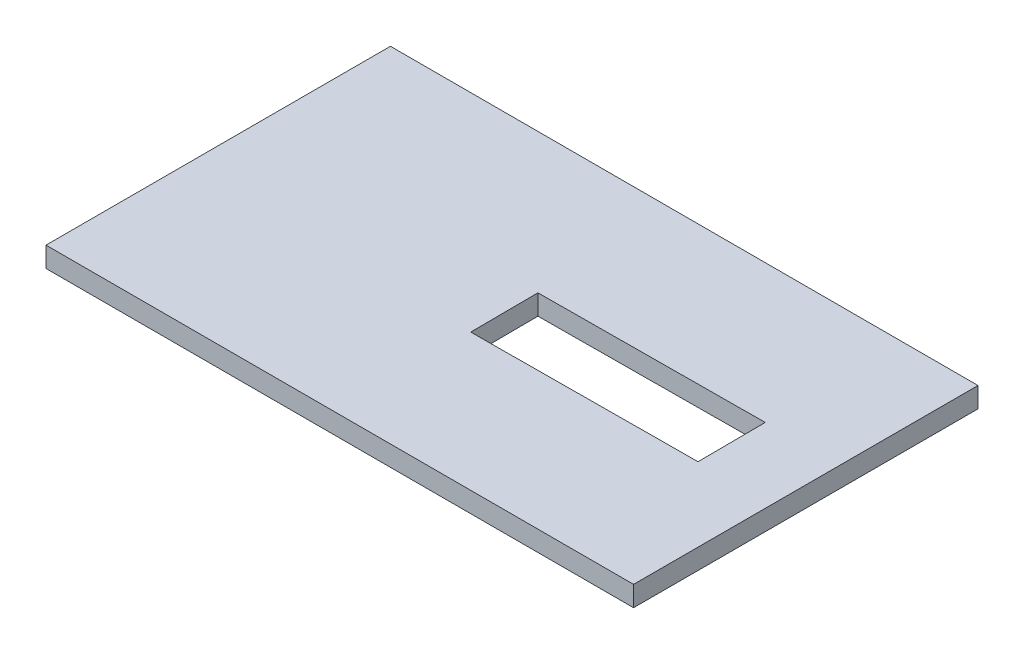
ISO-10303-21;
HEADER;
FILE_DESCRIPTION(('STEP AP214'),'2;1');
FILE_NAME('part.step','',(''),(''),'','','');
FILE_SCHEMA(('AUTOMOTIVE_DESIGN { 1 0 10303 214 1 1 1 1 }'));
ENDSEC;
DATA;
#1=APPLICATION_CONTEXT('core data for automotive mechanical design processes');
#2=APPLICATION_PROTOCOL_DEFINITION('international standard','automotive_design',2000,#1);
#3=PRODUCT_CONTEXT('',#1,'mechanical');
#4=PRODUCT('Part','Part','',(#3));
#5=PRODUCT_RELATED_PRODUCT_CATEGORY('part','',(#4));
#6=PRODUCT_DEFINITION_FORMATION('','',#4);
#7=PRODUCT_DEFINITION_CONTEXT('part definition',#1,'design');
#8=PRODUCT_DEFINITION('design','',#6,#7);
#9=PRODUCT_DEFINITION_SHAPE('','',#8);
#10=(LENGTH_UNIT() NAMED_UNIT(*) SI_UNIT(.MILLI.,.METRE.));
#11=(NAMED_UNIT(*) PLANE_ANGLE_UNIT() SI_UNIT($,.RADIAN.));
#12=(NAMED_UNIT(*) SI_UNIT($,.STERADIAN.) SOLID_ANGLE_UNIT());
#13=UNCERTAINTY_MEASURE_WITH_UNIT(LENGTH_MEASURE(1.E-05),#10,'distance_accuracy_value','');
#14=(GEOMETRIC_REPRESENTATION_CONTEXT(3) GLOBAL_UNCERTAINTY_ASSIGNED_CONTEXT((#13)) GLOBAL_UNIT_ASSIGNED_CONTEXT((#10,
#11,#12)) REPRESENTATION_CONTEXT('',''));
#15=CARTESIAN_POINT('',(0.,0.,0.));
#16=DIRECTION('',(0.,0.,1.));
#17=DIRECTION('',(1.,0.,0.));
#18=AXIS2_PLACEMENT_3D('',#15,#16,#17);
#19=CARTESIAN_POINT('',(0.,200.,0.));
#20=DIRECTION('',(1.,0.,0.));
#21=DIRECTION('',(0.,0.,-1.));
#22=AXIS2_PLACEMENT_3D('',#19,#20,#21);
#23=PLANE('',#22);
#24=DIRECTION('',(0.,0.,1.));
#25=VECTOR('',#24,1.);
#26=CARTESIAN_POINT('',(0.,0.,0.));
#27=LINE('',#26,#25);
#28=CARTESIAN_POINT('',(0.,0.,-3400.));
#29=VERTEX_POINT('',#28);
#30=CARTESIAN_POINT('',(0.,0.,0.));
#31=VERTEX_POINT('',#30);
#32=EDGE_CURVE('E133',#29,#31,#27,.T.);
#33=ORIENTED_EDGE('',*,*,#32,.T.);
#34=DIRECTION('',(0.,-1.,0.));
#35=VECTOR('',#34,1.);
#36=CARTESIAN_POINT('',(0.,200.,0.));
#37=LINE('',#36,#35);
#38=CARTESIAN_POINT('',(0.,200.,0.));
#39=VERTEX_POINT('',#38);
#40=EDGE_CURVE('E11',#39,#31,#37,.T.);
#41=ORIENTED_EDGE('',*,*,#40,.F.);
#42=DIRECTION('',(0.,0.,1.));
#43=VECTOR('',#42,1.);
#44=CARTESIAN_POINT('',(0.,200.,0.));
#45=LINE('',#44,#43);
#46=CARTESIAN_POINT('',(0.,200.,-3400.));
#47=VERTEX_POINT('',#46);
#48=EDGE_CURVE('E137',#47,#39,#45,.T.);
#49=ORIENTED_EDGE('',*,*,#48,.F.);
#50=DIRECTION('',(0.,-1.,0.));
#51=VECTOR('',#50,1.);
#52=CARTESIAN_POINT('',(0.,200.,-3400.));
#53=LINE('',#52,#51);
#54=EDGE_CURVE('E147',#47,#29,#53,.T.);
#55=ORIENTED_EDGE('',*,*,#54,.T.);
#56=EDGE_LOOP('',(#33,#41,#49,#55));
#57=FACE_BOUND('',#56,.T.);
#58=ADVANCED_FACE('F36',(#57),#23,.F.);
#59=CARTESIAN_POINT('',(0.,200.,0.));
#60=DIRECTION('',(0.,0.,-1.));
#61=DIRECTION('',(-1.,0.,0.));
#62=AXIS2_PLACEMENT_3D('',#59,#60,#61);
#63=PLANE('',#62);
#64=DIRECTION('',(1.,0.,0.));
#65=VECTOR('',#64,1.);
#66=CARTESIAN_POINT('',(0.,0.,0.));
#67=LINE('',#66,#65);
#68=CARTESIAN_POINT('',(5800.,0.,0.));
#69=VERTEX_POINT('',#68);
#70=EDGE_CURVE('E150',#31,#69,#67,.T.);
#71=ORIENTED_EDGE('',*,*,#70,.T.);
#72=DIRECTION('',(0.,-1.,0.));
#73=VECTOR('',#72,1.);
#74=CARTESIAN_POINT('',(5800.,200.,0.));
#75=LINE('',#74,#73);
#76=CARTESIAN_POINT('',(5800.,200.,0.));
#77=VERTEX_POINT('',#76);
#78=EDGE_CURVE('E43',#77,#69,#75,.T.);
#79=ORIENTED_EDGE('',*,*,#78,.F.);
#80=DIRECTION('',(1.,0.,0.));
#81=VECTOR('',#80,1.);
#82=CARTESIAN_POINT('',(0.,200.,0.));
#83=LINE('',#82,#81);
#84=EDGE_CURVE('E140',#39,#77,#83,.T.);
#85=ORIENTED_EDGE('',*,*,#84,.F.);
#86=ORIENTED_EDGE('',*,*,#40,.T.);
#87=EDGE_LOOP('',(#71,#79,#85,#86));
#88=FACE_BOUND('',#87,.T.);
#89=ADVANCED_FACE('F178',(#88),#63,.F.);
#90=CARTESIAN_POINT('',(5800.,200.,0.));
#91=DIRECTION('',(-1.,0.,0.));
#92=DIRECTION('',(0.,0.,1.));
#93=AXIS2_PLACEMENT_3D('',#90,#91,#92);
#94=PLANE('',#93);
#95=DIRECTION('',(0.,0.,-1.));
#96=VECTOR('',#95,1.);
#97=CARTESIAN_POINT('',(5800.,0.,0.));
#98=LINE('',#97,#96);
#99=CARTESIAN_POINT('',(5800.,0.,-3400.));
#100=VERTEX_POINT('',#99);
#101=EDGE_CURVE('E152',#69,#100,#98,.T.);
#102=ORIENTED_EDGE('',*,*,#101,.T.);
#103=DIRECTION('',(0.,-1.,0.));
#104=VECTOR('',#103,1.);
#105=CARTESIAN_POINT('',(5800.,200.,-3400.));
#106=LINE('',#105,#104);
#107=CARTESIAN_POINT('',(5800.,200.,-3400.));
#108=VERTEX_POINT('',#107);
#109=EDGE_CURVE('E157',#108,#100,#106,.T.);
#110=ORIENTED_EDGE('',*,*,#109,.F.);
#111=DIRECTION('',(0.,0.,-1.));
#112=VECTOR('',#111,1.);
#113=CARTESIAN_POINT('',(5800.,200.,0.));
#114=LINE('',#113,#112);
#115=EDGE_CURVE('E143',#77,#108,#114,.T.);
#116=ORIENTED_EDGE('',*,*,#115,.F.);
#117=ORIENTED_EDGE('',*,*,#78,.T.);
#118=EDGE_LOOP('',(#102,#110,#116,#117));
#119=FACE_BOUND('',#118,.T.);
#120=ADVANCED_FACE('F164',(#119),#94,.F.);
#121=CARTESIAN_POINT('',(0.,200.,-3400.));
#122=DIRECTION('',(0.,0.,1.));
#123=DIRECTION('',(1.,0.,0.));
#124=AXIS2_PLACEMENT_3D('',#121,#122,#123);
#125=PLANE('',#124);
#126=DIRECTION('',(-1.,0.,0.));
#127=VECTOR('',#126,1.);
#128=CARTESIAN_POINT('',(0.,0.,-3400.));
#129=LINE('',#128,#127);
#130=EDGE_CURVE('E141',#100,#29,#129,.T.);
#131=ORIENTED_EDGE('',*,*,#130,.T.);
#132=ORIENTED_EDGE('',*,*,#54,.F.);
#133=DIRECTION('',(-1.,0.,0.));
#134=VECTOR('',#133,1.);
#135=CARTESIAN_POINT('',(0.,200.,-3400.));
#136=LINE('',#135,#134);
#137=EDGE_CURVE('E145',#108,#47,#136,.T.);
#138=ORIENTED_EDGE('',*,*,#137,.F.);
#139=ORIENTED_EDGE('',*,*,#109,.T.);
#140=EDGE_LOOP('',(#131,#132,#138,#139));
#141=FACE_BOUND('',#140,.T.);
#142=ADVANCED_FACE('F171',(#141),#125,.F.);
#143=CARTESIAN_POINT('',(0.,200.,0.));
#144=DIRECTION('',(0.,-1.,0.));
#145=DIRECTION('',(0.,0.,-1.));
#146=AXIS2_PLACEMENT_3D('',#143,#144,#145);
#147=PLANE('',#146);
#148=DIRECTION('',(0.999980933674751,0.,-0.00617513457132064));
#149=VECTOR('',#148,1.);
#150=CARTESIAN_POINT('',(2839.77095898457,200.,-1352.90977999301));
#151=LINE('',#150,#149);
#152=CARTESIAN_POINT('',(2839.77095898457,200.,-1352.90977999301));
#153=VERTEX_POINT('',#152);
#154=CARTESIAN_POINT('',(5069.72942456457,200.,-1366.68033616032));
#155=VERTEX_POINT('',#154);
#156=EDGE_CURVE('E127',#153,#155,#151,.T.);
#157=ORIENTED_EDGE('',*,*,#156,.F.);
#158=DIRECTION('',(0.00617513457132033,0.,0.999980933674751));
#159=VECTOR('',#158,1.);
#160=CARTESIAN_POINT('',(2835.64978703,200.,-2020.27877922132));
#161=LINE('',#160,#159);
#162=CARTESIAN_POINT('',(2835.64978703,200.,-2020.27877922132));
#163=VERTEX_POINT('',#162);
#164=EDGE_CURVE('E50',#163,#153,#161,.T.);
#165=ORIENTED_EDGE('',*,*,#164,.F.);
#166=DIRECTION('',(-0.999980933674751,0.,0.00617513457132064));
#167=VECTOR('',#166,1.);
#168=CARTESIAN_POINT('',(2835.64978703,200.,-2020.27877922132));
#169=LINE('',#168,#167);
#170=CARTESIAN_POINT('',(5065.60825261,200.,-2034.04933538863));
#171=VERTEX_POINT('',#170);
#172=EDGE_CURVE('E118',#171,#163,#169,.T.);
#173=ORIENTED_EDGE('',*,*,#172,.F.);
#174=DIRECTION('',(-0.006175134571321,0.,-0.999980933674751));
#175=VECTOR('',#174,1.);
#176=CARTESIAN_POINT('',(5065.60825261,200.,-2034.04933538863));
#177=LINE('',#176,#175);
#178=EDGE_CURVE('E121',#155,#171,#177,.T.);
#179=ORIENTED_EDGE('',*,*,#178,.F.);
#180=EDGE_LOOP('',(#157,#165,#173,#179));
#181=FACE_BOUND('',#180,.T.);
#182=ORIENTED_EDGE('',*,*,#48,.T.);
#183=ORIENTED_EDGE('',*,*,#84,.T.);
#184=ORIENTED_EDGE('',*,*,#115,.T.);
#185=ORIENTED_EDGE('',*,*,#137,.T.);
#186=EDGE_LOOP('',(#182,#183,#184,#185));
#187=FACE_BOUND('',#186,.T.);
#188=ADVANCED_FACE('F177',(#181,#187),#147,.F.);
#189=CARTESIAN_POINT('',(0.,0.,0.));
#190=DIRECTION('',(0.,-1.,0.));
#191=DIRECTION('',(0.,0.,-1.));
#192=AXIS2_PLACEMENT_3D('',#189,#190,#191);
#193=PLANE('',#192);
#194=DIRECTION('',(0.00617513457132033,0.,0.999980933674751));
#195=VECTOR('',#194,1.);
#196=CARTESIAN_POINT('',(2835.64978703,0.,-2020.27877922132));
#197=LINE('',#196,#195);
#198=CARTESIAN_POINT('',(2835.64978703,0.,-2020.27877922132));
#199=VERTEX_POINT('',#198);
#200=CARTESIAN_POINT('',(2839.77095898457,0.,-1352.90977999301));
#201=VERTEX_POINT('',#200);
#202=EDGE_CURVE('E102',#199,#201,#197,.T.);
#203=ORIENTED_EDGE('',*,*,#202,.T.);
#204=DIRECTION('',(0.999980933674751,0.,-0.00617513457132064));
#205=VECTOR('',#204,1.);
#206=CARTESIAN_POINT('',(2839.77095898457,0.,-1352.90977999301));
#207=LINE('',#206,#205);
#208=CARTESIAN_POINT('',(5069.72942456457,0.,-1366.68033616032));
#209=VERTEX_POINT('',#208);
#210=EDGE_CURVE('E111',#201,#209,#207,.T.);
#211=ORIENTED_EDGE('',*,*,#210,.T.);
#212=DIRECTION('',(-0.006175134571321,0.,-0.999980933674751));
#213=VECTOR('',#212,1.);
#214=CARTESIAN_POINT('',(5065.60825261,0.,-2034.04933538863));
#215=LINE('',#214,#213);
#216=CARTESIAN_POINT('',(5065.60825261,0.,-2034.04933538863));
#217=VERTEX_POINT('',#216);
#218=EDGE_CURVE('E58',#209,#217,#215,.T.);
#219=ORIENTED_EDGE('',*,*,#218,.T.);
#220=DIRECTION('',(-0.999980933674751,0.,0.00617513457132064));
#221=VECTOR('',#220,1.);
#222=CARTESIAN_POINT('',(2835.64978703,0.,-2020.27877922132));
#223=LINE('',#222,#221);
#224=EDGE_CURVE('E108',#217,#199,#223,.T.);
#225=ORIENTED_EDGE('',*,*,#224,.T.);
#226=EDGE_LOOP('',(#203,#211,#219,#225));
#227=FACE_BOUND('',#226,.T.);
#228=ORIENTED_EDGE('',*,*,#32,.F.);
#229=ORIENTED_EDGE('',*,*,#130,.F.);
#230=ORIENTED_EDGE('',*,*,#101,.F.);
#231=ORIENTED_EDGE('',*,*,#70,.F.);
#232=EDGE_LOOP('',(#228,#229,#230,#231));
#233=FACE_BOUND('',#232,.T.);
#234=ADVANCED_FACE('F115',(#227,#233),#193,.T.);
#235=CARTESIAN_POINT('',(2835.64978703,0.,-2020.27877922132));
#236=DIRECTION('',(-0.999980933674751,0.,0.00617513457132034));
#237=DIRECTION('',(0.00617513457132034,0.,0.999980933674751));
#238=AXIS2_PLACEMENT_3D('',#235,#236,#237);
#239=PLANE('',#238);
#240=ORIENTED_EDGE('',*,*,#164,.T.);
#241=DIRECTION('',(0.,1.,0.));
#242=VECTOR('',#241,1.);
#243=CARTESIAN_POINT('',(2839.77095898457,0.,-1352.90977999301));
#244=LINE('',#243,#242);
#245=EDGE_CURVE('E98',#201,#153,#244,.T.);
#246=ORIENTED_EDGE('',*,*,#245,.F.);
#247=ORIENTED_EDGE('',*,*,#202,.F.);
#248=DIRECTION('',(0.,1.,0.));
#249=VECTOR('',#248,1.);
#250=CARTESIAN_POINT('',(2835.64978703,0.,-2020.27877922132));
#251=LINE('',#250,#249);
#252=EDGE_CURVE('E131',#199,#163,#251,.T.);
#253=ORIENTED_EDGE('',*,*,#252,.T.);
#254=EDGE_LOOP('',(#240,#246,#247,#253));
#255=FACE_BOUND('',#254,.T.);
#256=ADVANCED_FACE('F100',(#255),#239,.F.);
#257=CARTESIAN_POINT('',(2835.64978703,0.,-2020.27877922132));
#258=DIRECTION('',(-0.00617513457132064,0.,-0.999980933674751));
#259=DIRECTION('',(-0.999980933674751,0.,0.00617513457132064));
#260=AXIS2_PLACEMENT_3D('',#257,#258,#259);
#261=PLANE('',#260);
#262=ORIENTED_EDGE('',*,*,#172,.T.);
#263=ORIENTED_EDGE('',*,*,#252,.F.);
#264=ORIENTED_EDGE('',*,*,#224,.F.);
#265=DIRECTION('',(0.,1.,0.));
#266=VECTOR('',#265,1.);
#267=CARTESIAN_POINT('',(5065.60825261,0.,-2034.04933538863));
#268=LINE('',#267,#266);
#269=EDGE_CURVE('E134',#217,#171,#268,.T.);
#270=ORIENTED_EDGE('',*,*,#269,.T.);
#271=EDGE_LOOP('',(#262,#263,#264,#270));
#272=FACE_BOUND('',#271,.T.);
#273=ADVANCED_FACE('F195',(#272),#261,.F.);
#274=CARTESIAN_POINT('',(5065.60825261,0.,-2034.04933538863));
#275=DIRECTION('',(0.999980933674751,0.,-0.006175134571321));
#276=DIRECTION('',(-0.006175134571321,0.,-0.999980933674751));
#277=AXIS2_PLACEMENT_3D('',#274,#275,#276);
#278=PLANE('',#277);
#279=ORIENTED_EDGE('',*,*,#178,.T.);
#280=ORIENTED_EDGE('',*,*,#269,.F.);
#281=ORIENTED_EDGE('',*,*,#218,.F.);
#282=DIRECTION('',(0.,1.,0.));
#283=VECTOR('',#282,1.);
#284=CARTESIAN_POINT('',(5069.72942456457,0.,-1366.68033616032));
#285=LINE('',#284,#283);
#286=EDGE_CURVE('E107',#209,#155,#285,.T.);
#287=ORIENTED_EDGE('',*,*,#286,.T.);
#288=EDGE_LOOP('',(#279,#280,#281,#287));
#289=FACE_BOUND('',#288,.T.);
#290=ADVANCED_FACE('F198',(#289),#278,.F.);
#291=CARTESIAN_POINT('',(2839.77095898457,0.,-1352.90977999301));
#292=DIRECTION('',(0.00617513457132064,0.,0.999980933674751));
#293=DIRECTION('',(0.999980933674751,0.,-0.00617513457132064));
#294=AXIS2_PLACEMENT_3D('',#291,#292,#293);
#295=PLANE('',#294);
#296=ORIENTED_EDGE('',*,*,#156,.T.);
#297=ORIENTED_EDGE('',*,*,#286,.F.);
#298=ORIENTED_EDGE('',*,*,#210,.F.);
#299=ORIENTED_EDGE('',*,*,#245,.T.);
#300=EDGE_LOOP('',(#296,#297,#298,#299));
#301=FACE_BOUND('',#300,.T.);
#302=ADVANCED_FACE('F112',(#301),#295,.F.);
#303=CLOSED_SHELL('',(#58,#89,#120,#142,#188,#234,#256,#273,#290,#302));
#304=MANIFOLD_SOLID_BREP('B2',#303);
#305=ADVANCED_BREP_SHAPE_REPRESENTATION('',(#18,#304),#14);
#306=SHAPE_DEFINITION_REPRESENTATION(#9,#305);
ENDSEC;
END-ISO-10303-21;
